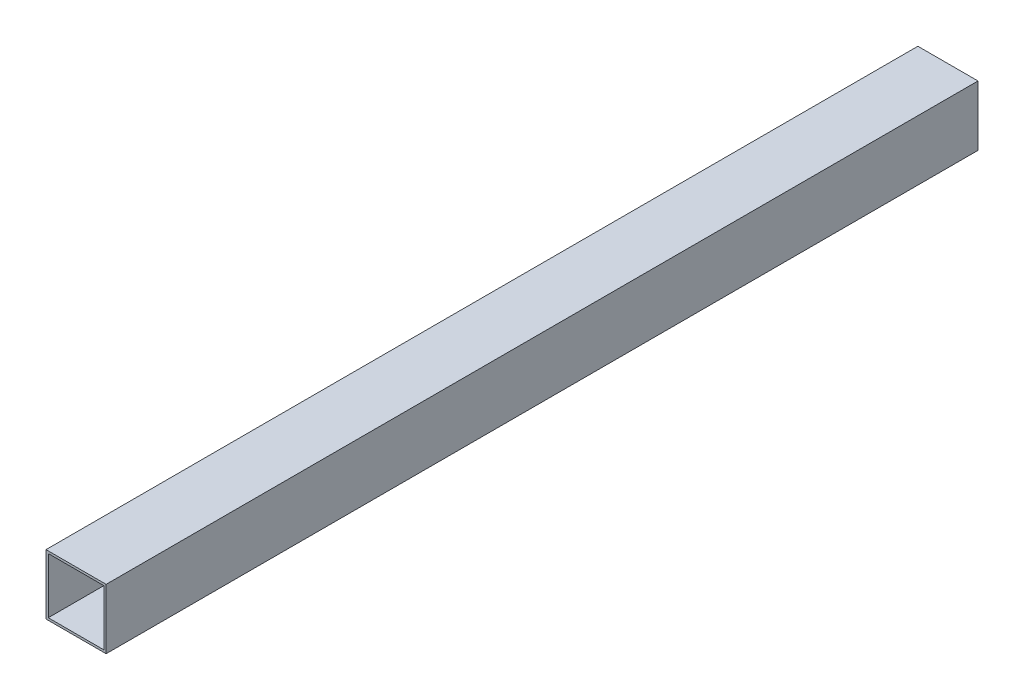
ISO-10303-21;
HEADER;
FILE_DESCRIPTION(('STEP AP214'),'2;1');
FILE_NAME('part.step','',(''),(''),'','','');
FILE_SCHEMA(('AUTOMOTIVE_DESIGN { 1 0 10303 214 1 1 1 1 }'));
ENDSEC;
DATA;
#1=APPLICATION_CONTEXT('core data for automotive mechanical design processes');
#2=APPLICATION_PROTOCOL_DEFINITION('international standard','automotive_design',2000,#1);
#3=PRODUCT_CONTEXT('',#1,'mechanical');
#4=PRODUCT('Part','Part','',(#3));
#5=PRODUCT_RELATED_PRODUCT_CATEGORY('part','',(#4));
#6=PRODUCT_DEFINITION_FORMATION('','',#4);
#7=PRODUCT_DEFINITION_CONTEXT('part definition',#1,'design');
#8=PRODUCT_DEFINITION('design','',#6,#7);
#9=PRODUCT_DEFINITION_SHAPE('','',#8);
#10=(LENGTH_UNIT() NAMED_UNIT(*) SI_UNIT(.MILLI.,.METRE.));
#11=(NAMED_UNIT(*) PLANE_ANGLE_UNIT() SI_UNIT($,.RADIAN.));
#12=(NAMED_UNIT(*) SI_UNIT($,.STERADIAN.) SOLID_ANGLE_UNIT());
#13=UNCERTAINTY_MEASURE_WITH_UNIT(LENGTH_MEASURE(1.E-05),#10,'distance_accuracy_value','');
#14=(GEOMETRIC_REPRESENTATION_CONTEXT(3) GLOBAL_UNCERTAINTY_ASSIGNED_CONTEXT((#13)) GLOBAL_UNIT_ASSIGNED_CONTEXT((#10,
#11,#12)) REPRESENTATION_CONTEXT('',''));
#15=CARTESIAN_POINT('',(0.,0.,0.));
#16=DIRECTION('',(0.,0.,1.));
#17=DIRECTION('',(1.,0.,0.));
#18=AXIS2_PLACEMENT_3D('',#15,#16,#17);
#19=CARTESIAN_POINT('',(0.,0.,580.));
#20=DIRECTION('',(0.,0.,-1.));
#21=DIRECTION('',(-1.,0.,0.));
#22=AXIS2_PLACEMENT_3D('',#19,#20,#21);
#23=PLANE('',#22);
#24=DIRECTION('',(0.,1.,0.));
#25=VECTOR('',#24,1.);
#26=CARTESIAN_POINT('',(20.,-20.,580.));
#27=LINE('',#26,#25);
#28=CARTESIAN_POINT('',(20.,-20.,580.));
#29=VERTEX_POINT('',#28);
#30=CARTESIAN_POINT('',(20.,20.,580.));
#31=VERTEX_POINT('',#30);
#32=EDGE_CURVE('E134',#29,#31,#27,.T.);
#33=ORIENTED_EDGE('',*,*,#32,.T.);
#34=DIRECTION('',(-1.,0.,0.));
#35=VECTOR('',#34,1.);
#36=CARTESIAN_POINT('',(-20.,20.,580.));
#37=LINE('',#36,#35);
#38=CARTESIAN_POINT('',(-20.,20.,580.));
#39=VERTEX_POINT('',#38);
#40=EDGE_CURVE('E137',#31,#39,#37,.T.);
#41=ORIENTED_EDGE('',*,*,#40,.T.);
#42=DIRECTION('',(0.,-1.,0.));
#43=VECTOR('',#42,1.);
#44=CARTESIAN_POINT('',(-20.,-20.,580.));
#45=LINE('',#44,#43);
#46=CARTESIAN_POINT('',(-20.,-20.,580.));
#47=VERTEX_POINT('',#46);
#48=EDGE_CURVE('E140',#39,#47,#45,.T.);
#49=ORIENTED_EDGE('',*,*,#48,.T.);
#50=DIRECTION('',(1.,0.,0.));
#51=VECTOR('',#50,1.);
#52=CARTESIAN_POINT('',(-20.,-20.,580.));
#53=LINE('',#52,#51);
#54=EDGE_CURVE('E142',#47,#29,#53,.T.);
#55=ORIENTED_EDGE('',*,*,#54,.T.);
#56=EDGE_LOOP('',(#33,#41,#49,#55));
#57=FACE_BOUND('',#56,.T.);
#58=DIRECTION('',(0.,1.,0.));
#59=VECTOR('',#58,1.);
#60=CARTESIAN_POINT('',(18.5,-18.5,580.));
#61=LINE('',#60,#59);
#62=CARTESIAN_POINT('',(18.5,-18.5,580.));
#63=VERTEX_POINT('',#62);
#64=CARTESIAN_POINT('',(18.5,18.5,580.));
#65=VERTEX_POINT('',#64);
#66=EDGE_CURVE('E98',#63,#65,#61,.T.);
#67=ORIENTED_EDGE('',*,*,#66,.F.);
#68=DIRECTION('',(1.,0.,0.));
#69=VECTOR('',#68,1.);
#70=CARTESIAN_POINT('',(-18.5,-18.5,580.));
#71=LINE('',#70,#69);
#72=CARTESIAN_POINT('',(-18.5,-18.5,580.));
#73=VERTEX_POINT('',#72);
#74=EDGE_CURVE('E120',#73,#63,#71,.T.);
#75=ORIENTED_EDGE('',*,*,#74,.F.);
#76=DIRECTION('',(0.,-1.,0.));
#77=VECTOR('',#76,1.);
#78=CARTESIAN_POINT('',(-18.5,-18.5,580.));
#79=LINE('',#78,#77);
#80=CARTESIAN_POINT('',(-18.5,18.5,580.));
#81=VERTEX_POINT('',#80);
#82=EDGE_CURVE('E118',#81,#73,#79,.T.);
#83=ORIENTED_EDGE('',*,*,#82,.F.);
#84=DIRECTION('',(-1.,0.,0.));
#85=VECTOR('',#84,1.);
#86=CARTESIAN_POINT('',(-18.5,18.5,580.));
#87=LINE('',#86,#85);
#88=EDGE_CURVE('E106',#65,#81,#87,.T.);
#89=ORIENTED_EDGE('',*,*,#88,.F.);
#90=EDGE_LOOP('',(#67,#75,#83,#89));
#91=FACE_BOUND('',#90,.T.);
#92=ADVANCED_FACE('F33',(#57,#91),#23,.F.);
#93=CARTESIAN_POINT('',(0.,0.,0.));
#94=DIRECTION('',(0.,0.,-1.));
#95=DIRECTION('',(-1.,0.,0.));
#96=AXIS2_PLACEMENT_3D('',#93,#94,#95);
#97=PLANE('',#96);
#98=DIRECTION('',(0.,1.,0.));
#99=VECTOR('',#98,1.);
#100=CARTESIAN_POINT('',(20.,-20.,0.));
#101=LINE('',#100,#99);
#102=CARTESIAN_POINT('',(20.,-20.,0.));
#103=VERTEX_POINT('',#102);
#104=CARTESIAN_POINT('',(20.,20.,0.));
#105=VERTEX_POINT('',#104);
#106=EDGE_CURVE('E114',#103,#105,#101,.T.);
#107=ORIENTED_EDGE('',*,*,#106,.F.);
#108=DIRECTION('',(1.,0.,0.));
#109=VECTOR('',#108,1.);
#110=CARTESIAN_POINT('',(-20.,-20.,0.));
#111=LINE('',#110,#109);
#112=CARTESIAN_POINT('',(-20.,-20.,0.));
#113=VERTEX_POINT('',#112);
#114=EDGE_CURVE('E138',#113,#103,#111,.T.);
#115=ORIENTED_EDGE('',*,*,#114,.F.);
#116=DIRECTION('',(0.,-1.,0.));
#117=VECTOR('',#116,1.);
#118=CARTESIAN_POINT('',(-20.,-20.,0.));
#119=LINE('',#118,#117);
#120=CARTESIAN_POINT('',(-20.,20.,0.));
#121=VERTEX_POINT('',#120);
#122=EDGE_CURVE('E149',#121,#113,#119,.T.);
#123=ORIENTED_EDGE('',*,*,#122,.F.);
#124=DIRECTION('',(-1.,0.,0.));
#125=VECTOR('',#124,1.);
#126=CARTESIAN_POINT('',(-20.,20.,0.));
#127=LINE('',#126,#125);
#128=EDGE_CURVE('E147',#105,#121,#127,.T.);
#129=ORIENTED_EDGE('',*,*,#128,.F.);
#130=EDGE_LOOP('',(#107,#115,#123,#129));
#131=FACE_BOUND('',#130,.T.);
#132=DIRECTION('',(1.,0.,0.));
#133=VECTOR('',#132,1.);
#134=CARTESIAN_POINT('',(-18.5,-18.5,0.));
#135=LINE('',#134,#133);
#136=CARTESIAN_POINT('',(-18.5,-18.5,0.));
#137=VERTEX_POINT('',#136);
#138=CARTESIAN_POINT('',(18.5,-18.5,0.));
#139=VERTEX_POINT('',#138);
#140=EDGE_CURVE('E107',#137,#139,#135,.T.);
#141=ORIENTED_EDGE('',*,*,#140,.T.);
#142=DIRECTION('',(0.,1.,0.));
#143=VECTOR('',#142,1.);
#144=CARTESIAN_POINT('',(18.5,-18.5,0.));
#145=LINE('',#144,#143);
#146=CARTESIAN_POINT('',(18.5,18.5,0.));
#147=VERTEX_POINT('',#146);
#148=EDGE_CURVE('E56',#139,#147,#145,.T.);
#149=ORIENTED_EDGE('',*,*,#148,.T.);
#150=DIRECTION('',(-1.,0.,0.));
#151=VECTOR('',#150,1.);
#152=CARTESIAN_POINT('',(-18.5,18.5,0.));
#153=LINE('',#152,#151);
#154=CARTESIAN_POINT('',(-18.5,18.5,0.));
#155=VERTEX_POINT('',#154);
#156=EDGE_CURVE('E113',#147,#155,#153,.T.);
#157=ORIENTED_EDGE('',*,*,#156,.T.);
#158=DIRECTION('',(0.,-1.,0.));
#159=VECTOR('',#158,1.);
#160=CARTESIAN_POINT('',(-18.5,-18.5,0.));
#161=LINE('',#160,#159);
#162=EDGE_CURVE('E126',#155,#137,#161,.T.);
#163=ORIENTED_EDGE('',*,*,#162,.T.);
#164=EDGE_LOOP('',(#141,#149,#157,#163));
#165=FACE_BOUND('',#164,.T.);
#166=ADVANCED_FACE('F167',(#131,#165),#97,.T.);
#167=CARTESIAN_POINT('',(20.,-20.,580.));
#168=DIRECTION('',(-1.,0.,0.));
#169=DIRECTION('',(0.,0.,1.));
#170=AXIS2_PLACEMENT_3D('',#167,#168,#169);
#171=PLANE('',#170);
#172=ORIENTED_EDGE('',*,*,#106,.T.);
#173=DIRECTION('',(0.,0.,-1.));
#174=VECTOR('',#173,1.);
#175=CARTESIAN_POINT('',(20.,20.,580.));
#176=LINE('',#175,#174);
#177=EDGE_CURVE('E11',#31,#105,#176,.T.);
#178=ORIENTED_EDGE('',*,*,#177,.F.);
#179=ORIENTED_EDGE('',*,*,#32,.F.);
#180=DIRECTION('',(0.,0.,-1.));
#181=VECTOR('',#180,1.);
#182=CARTESIAN_POINT('',(20.,-20.,580.));
#183=LINE('',#182,#181);
#184=EDGE_CURVE('E144',#29,#103,#183,.T.);
#185=ORIENTED_EDGE('',*,*,#184,.T.);
#186=EDGE_LOOP('',(#172,#178,#179,#185));
#187=FACE_BOUND('',#186,.T.);
#188=ADVANCED_FACE('F35',(#187),#171,.F.);
#189=CARTESIAN_POINT('',(-20.,20.,580.));
#190=DIRECTION('',(0.,-1.,0.));
#191=DIRECTION('',(0.,0.,-1.));
#192=AXIS2_PLACEMENT_3D('',#189,#190,#191);
#193=PLANE('',#192);
#194=ORIENTED_EDGE('',*,*,#128,.T.);
#195=DIRECTION('',(0.,0.,-1.));
#196=VECTOR('',#195,1.);
#197=CARTESIAN_POINT('',(-20.,20.,580.));
#198=LINE('',#197,#196);
#199=EDGE_CURVE('E41',#39,#121,#198,.T.);
#200=ORIENTED_EDGE('',*,*,#199,.F.);
#201=ORIENTED_EDGE('',*,*,#40,.F.);
#202=ORIENTED_EDGE('',*,*,#177,.T.);
#203=EDGE_LOOP('',(#194,#200,#201,#202));
#204=FACE_BOUND('',#203,.T.);
#205=ADVANCED_FACE('F177',(#204),#193,.F.);
#206=CARTESIAN_POINT('',(-20.,-20.,580.));
#207=DIRECTION('',(1.,0.,0.));
#208=DIRECTION('',(0.,0.,-1.));
#209=AXIS2_PLACEMENT_3D('',#206,#207,#208);
#210=PLANE('',#209);
#211=ORIENTED_EDGE('',*,*,#122,.T.);
#212=DIRECTION('',(0.,0.,-1.));
#213=VECTOR('',#212,1.);
#214=CARTESIAN_POINT('',(-20.,-20.,580.));
#215=LINE('',#214,#213);
#216=EDGE_CURVE('E154',#47,#113,#215,.T.);
#217=ORIENTED_EDGE('',*,*,#216,.F.);
#218=ORIENTED_EDGE('',*,*,#48,.F.);
#219=ORIENTED_EDGE('',*,*,#199,.T.);
#220=EDGE_LOOP('',(#211,#217,#218,#219));
#221=FACE_BOUND('',#220,.T.);
#222=ADVANCED_FACE('F161',(#221),#210,.F.);
#223=CARTESIAN_POINT('',(-20.,-20.,580.));
#224=DIRECTION('',(0.,1.,0.));
#225=DIRECTION('',(0.,0.,1.));
#226=AXIS2_PLACEMENT_3D('',#223,#224,#225);
#227=PLANE('',#226);
#228=ORIENTED_EDGE('',*,*,#114,.T.);
#229=ORIENTED_EDGE('',*,*,#184,.F.);
#230=ORIENTED_EDGE('',*,*,#54,.F.);
#231=ORIENTED_EDGE('',*,*,#216,.T.);
#232=EDGE_LOOP('',(#228,#229,#230,#231));
#233=FACE_BOUND('',#232,.T.);
#234=ADVANCED_FACE('F171',(#233),#227,.F.);
#235=CARTESIAN_POINT('',(18.5,-18.5,580.));
#236=DIRECTION('',(-1.,0.,0.));
#237=DIRECTION('',(0.,0.,1.));
#238=AXIS2_PLACEMENT_3D('',#235,#236,#237);
#239=PLANE('',#238);
#240=ORIENTED_EDGE('',*,*,#148,.F.);
#241=DIRECTION('',(0.,0.,-1.));
#242=VECTOR('',#241,1.);
#243=CARTESIAN_POINT('',(18.5,-18.5,580.));
#244=LINE('',#243,#242);
#245=EDGE_CURVE('E102',#63,#139,#244,.T.);
#246=ORIENTED_EDGE('',*,*,#245,.F.);
#247=ORIENTED_EDGE('',*,*,#66,.T.);
#248=DIRECTION('',(0.,0.,-1.));
#249=VECTOR('',#248,1.);
#250=CARTESIAN_POINT('',(18.5,18.5,580.));
#251=LINE('',#250,#249);
#252=EDGE_CURVE('E101',#65,#147,#251,.T.);
#253=ORIENTED_EDGE('',*,*,#252,.T.);
#254=EDGE_LOOP('',(#240,#246,#247,#253));
#255=FACE_BOUND('',#254,.T.);
#256=ADVANCED_FACE('F100',(#255),#239,.T.);
#257=CARTESIAN_POINT('',(-18.5,18.5,580.));
#258=DIRECTION('',(0.,-1.,0.));
#259=DIRECTION('',(0.,0.,-1.));
#260=AXIS2_PLACEMENT_3D('',#257,#258,#259);
#261=PLANE('',#260);
#262=ORIENTED_EDGE('',*,*,#156,.F.);
#263=ORIENTED_EDGE('',*,*,#252,.F.);
#264=ORIENTED_EDGE('',*,*,#88,.T.);
#265=DIRECTION('',(0.,0.,-1.));
#266=VECTOR('',#265,1.);
#267=CARTESIAN_POINT('',(-18.5,18.5,580.));
#268=LINE('',#267,#266);
#269=EDGE_CURVE('E115',#81,#155,#268,.T.);
#270=ORIENTED_EDGE('',*,*,#269,.T.);
#271=EDGE_LOOP('',(#262,#263,#264,#270));
#272=FACE_BOUND('',#271,.T.);
#273=ADVANCED_FACE('F110',(#272),#261,.T.);
#274=CARTESIAN_POINT('',(-18.5,-18.5,580.));
#275=DIRECTION('',(1.,0.,0.));
#276=DIRECTION('',(0.,0.,-1.));
#277=AXIS2_PLACEMENT_3D('',#274,#275,#276);
#278=PLANE('',#277);
#279=ORIENTED_EDGE('',*,*,#162,.F.);
#280=ORIENTED_EDGE('',*,*,#269,.F.);
#281=ORIENTED_EDGE('',*,*,#82,.T.);
#282=DIRECTION('',(0.,0.,-1.));
#283=VECTOR('',#282,1.);
#284=CARTESIAN_POINT('',(-18.5,-18.5,580.));
#285=LINE('',#284,#283);
#286=EDGE_CURVE('E48',#73,#137,#285,.T.);
#287=ORIENTED_EDGE('',*,*,#286,.T.);
#288=EDGE_LOOP('',(#279,#280,#281,#287));
#289=FACE_BOUND('',#288,.T.);
#290=ADVANCED_FACE('F200',(#289),#278,.T.);
#291=CARTESIAN_POINT('',(-18.5,-18.5,580.));
#292=DIRECTION('',(0.,1.,0.));
#293=DIRECTION('',(0.,0.,1.));
#294=AXIS2_PLACEMENT_3D('',#291,#292,#293);
#295=PLANE('',#294);
#296=ORIENTED_EDGE('',*,*,#140,.F.);
#297=ORIENTED_EDGE('',*,*,#286,.F.);
#298=ORIENTED_EDGE('',*,*,#74,.T.);
#299=ORIENTED_EDGE('',*,*,#245,.T.);
#300=EDGE_LOOP('',(#296,#297,#298,#299));
#301=FACE_BOUND('',#300,.T.);
#302=ADVANCED_FACE('F204',(#301),#295,.T.);
#303=CLOSED_SHELL('',(#92,#166,#188,#205,#222,#234,#256,#273,#290,#302));
#304=MANIFOLD_SOLID_BREP('B2',#303);
#305=ADVANCED_BREP_SHAPE_REPRESENTATION('',(#18,#304),#14);
#306=SHAPE_DEFINITION_REPRESENTATION(#9,#305);
ENDSEC;
END-ISO-10303-21;
